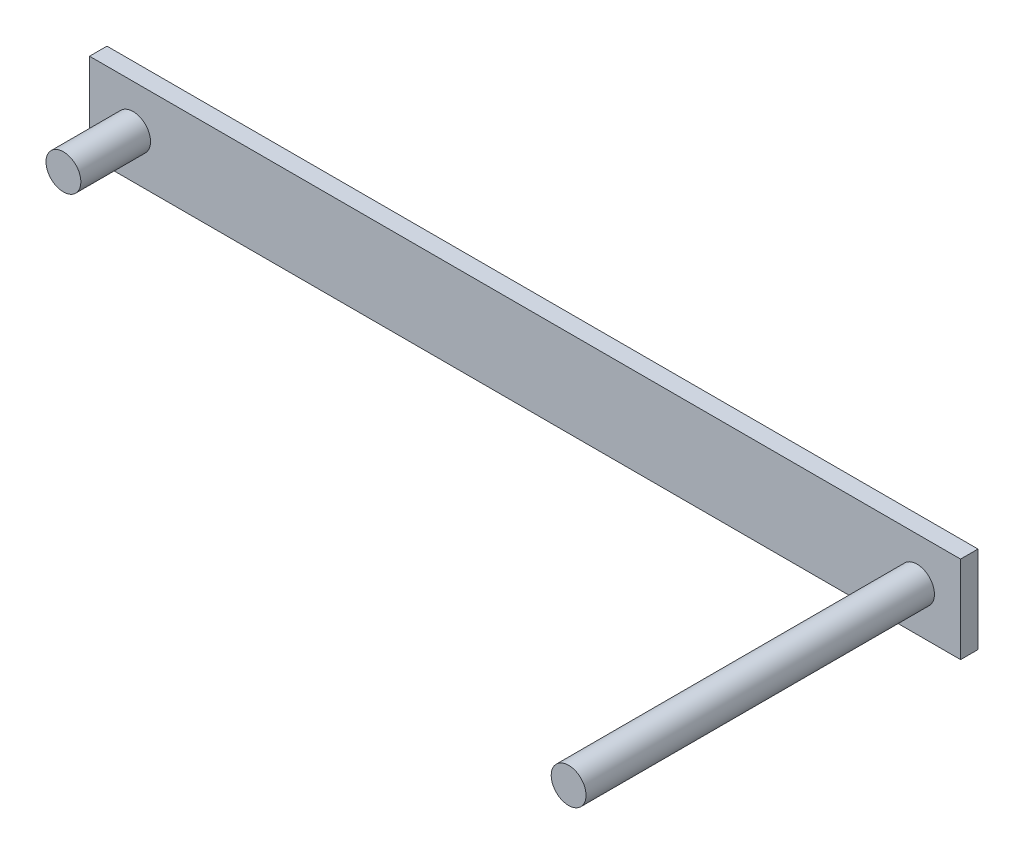
ISO-10303-21;
HEADER;
FILE_DESCRIPTION(('STEP AP214'),'2;1');
FILE_NAME('part.step','',(''),(''),'','','');
FILE_SCHEMA(('AUTOMOTIVE_DESIGN { 1 0 10303 214 1 1 1 1 }'));
ENDSEC;
DATA;
#1=APPLICATION_CONTEXT('core data for automotive mechanical design processes');
#2=APPLICATION_PROTOCOL_DEFINITION('international standard','automotive_design',2000,#1);
#3=PRODUCT_CONTEXT('',#1,'mechanical');
#4=PRODUCT('Part','Part','',(#3));
#5=PRODUCT_RELATED_PRODUCT_CATEGORY('part','',(#4));
#6=PRODUCT_DEFINITION_FORMATION('','',#4);
#7=PRODUCT_DEFINITION_CONTEXT('part definition',#1,'design');
#8=PRODUCT_DEFINITION('design','',#6,#7);
#9=PRODUCT_DEFINITION_SHAPE('','',#8);
#10=(LENGTH_UNIT() NAMED_UNIT(*) SI_UNIT(.MILLI.,.METRE.));
#11=(NAMED_UNIT(*) PLANE_ANGLE_UNIT() SI_UNIT($,.RADIAN.));
#12=(NAMED_UNIT(*) SI_UNIT($,.STERADIAN.) SOLID_ANGLE_UNIT());
#13=UNCERTAINTY_MEASURE_WITH_UNIT(LENGTH_MEASURE(1.E-05),#10,'distance_accuracy_value','');
#14=(GEOMETRIC_REPRESENTATION_CONTEXT(3) GLOBAL_UNCERTAINTY_ASSIGNED_CONTEXT((#13)) GLOBAL_UNIT_ASSIGNED_CONTEXT((#10,
#11,#12)) REPRESENTATION_CONTEXT('',''));
#15=CARTESIAN_POINT('',(0.,0.,0.));
#16=DIRECTION('',(0.,0.,1.));
#17=DIRECTION('',(1.,0.,0.));
#18=AXIS2_PLACEMENT_3D('',#15,#16,#17);
#19=CARTESIAN_POINT('',(0.,50.,10.));
#20=DIRECTION('',(0.,0.,-1.));
#21=DIRECTION('',(-1.,0.,0.));
#22=AXIS2_PLACEMENT_3D('',#19,#20,#21);
#23=PLANE('',#22);
#24=CARTESIAN_POINT('',(25.,25.,10.));
#25=DIRECTION('',(0.,0.,-1.));
#26=DIRECTION('',(-1.,0.,0.));
#27=AXIS2_PLACEMENT_3D('',#24,#25,#26);
#28=CIRCLE('',#27,10.);
#29=CARTESIAN_POINT('',(15.,25.,10.));
#30=VERTEX_POINT('',#29);
#31=EDGE_CURVE('E28',#30,#30,#28,.F.);
#32=ORIENTED_EDGE('',*,*,#31,.F.);
#33=EDGE_LOOP('',(#32));
#34=FACE_BOUND('',#33,.T.);
#35=DIRECTION('',(0.,-1.,0.));
#36=VECTOR('',#35,1.);
#37=CARTESIAN_POINT('',(0.,0.,10.));
#38=LINE('',#37,#36);
#39=CARTESIAN_POINT('',(0.,50.,10.));
#40=VERTEX_POINT('',#39);
#41=CARTESIAN_POINT('',(0.,0.,10.));
#42=VERTEX_POINT('',#41);
#43=EDGE_CURVE('E72',#40,#42,#38,.T.);
#44=ORIENTED_EDGE('',*,*,#43,.T.);
#45=DIRECTION('',(1.,0.,0.));
#46=VECTOR('',#45,1.);
#47=CARTESIAN_POINT('',(0.,0.,10.));
#48=LINE('',#47,#46);
#49=CARTESIAN_POINT('',(500.,0.,10.));
#50=VERTEX_POINT('',#49);
#51=EDGE_CURVE('E67',#42,#50,#48,.T.);
#52=ORIENTED_EDGE('',*,*,#51,.T.);
#53=DIRECTION('',(0.,1.,0.));
#54=VECTOR('',#53,1.);
#55=CARTESIAN_POINT('',(500.,0.,10.));
#56=LINE('',#55,#54);
#57=CARTESIAN_POINT('',(500.,50.,10.));
#58=VERTEX_POINT('',#57);
#59=EDGE_CURVE('E70',#50,#58,#56,.T.);
#60=ORIENTED_EDGE('',*,*,#59,.T.);
#61=DIRECTION('',(-1.,0.,0.));
#62=VECTOR('',#61,1.);
#63=CARTESIAN_POINT('',(0.,50.,10.));
#64=LINE('',#63,#62);
#65=EDGE_CURVE('E36',#58,#40,#64,.T.);
#66=ORIENTED_EDGE('',*,*,#65,.T.);
#67=EDGE_LOOP('',(#44,#52,#60,#66));
#68=FACE_BOUND('',#67,.T.);
#69=CARTESIAN_POINT('',(475.,25.,10.));
#70=DIRECTION('',(0.,0.,-1.));
#71=DIRECTION('',(-1.,0.,0.));
#72=AXIS2_PLACEMENT_3D('',#69,#70,#71);
#73=CIRCLE('',#72,10.);
#74=CARTESIAN_POINT('',(465.,25.,10.));
#75=VERTEX_POINT('',#74);
#76=EDGE_CURVE('E11',#75,#75,#73,.F.);
#77=ORIENTED_EDGE('',*,*,#76,.F.);
#78=EDGE_LOOP('',(#77));
#79=FACE_BOUND('',#78,.T.);
#80=ADVANCED_FACE('F19',(#34,#68,#79),#23,.F.);
#81=CARTESIAN_POINT('',(0.,0.,10.));
#82=DIRECTION('',(1.,0.,0.));
#83=DIRECTION('',(0.,0.,-1.));
#84=AXIS2_PLACEMENT_3D('',#81,#82,#83);
#85=PLANE('',#84);
#86=DIRECTION('',(0.,-1.,0.));
#87=VECTOR('',#86,1.);
#88=CARTESIAN_POINT('',(0.,0.,0.));
#89=LINE('',#88,#87);
#90=CARTESIAN_POINT('',(0.,50.,0.));
#91=VERTEX_POINT('',#90);
#92=CARTESIAN_POINT('',(0.,0.,0.));
#93=VERTEX_POINT('',#92);
#94=EDGE_CURVE('E87',#91,#93,#89,.T.);
#95=ORIENTED_EDGE('',*,*,#94,.T.);
#96=DIRECTION('',(0.,0.,-1.));
#97=VECTOR('',#96,1.);
#98=CARTESIAN_POINT('',(0.,0.,10.));
#99=LINE('',#98,#97);
#100=EDGE_CURVE('E78',#42,#93,#99,.T.);
#101=ORIENTED_EDGE('',*,*,#100,.F.);
#102=ORIENTED_EDGE('',*,*,#43,.F.);
#103=DIRECTION('',(0.,0.,-1.));
#104=VECTOR('',#103,1.);
#105=CARTESIAN_POINT('',(0.,50.,10.));
#106=LINE('',#105,#104);
#107=EDGE_CURVE('E83',#40,#91,#106,.T.);
#108=ORIENTED_EDGE('',*,*,#107,.T.);
#109=EDGE_LOOP('',(#95,#101,#102,#108));
#110=FACE_BOUND('',#109,.T.);
#111=ADVANCED_FACE('F21',(#110),#85,.F.);
#112=CARTESIAN_POINT('',(0.,0.,10.));
#113=DIRECTION('',(0.,1.,0.));
#114=DIRECTION('',(0.,0.,1.));
#115=AXIS2_PLACEMENT_3D('',#112,#113,#114);
#116=PLANE('',#115);
#117=DIRECTION('',(1.,0.,0.));
#118=VECTOR('',#117,1.);
#119=CARTESIAN_POINT('',(0.,0.,0.));
#120=LINE('',#119,#118);
#121=CARTESIAN_POINT('',(500.,0.,0.));
#122=VERTEX_POINT('',#121);
#123=EDGE_CURVE('E77',#93,#122,#120,.T.);
#124=ORIENTED_EDGE('',*,*,#123,.T.);
#125=DIRECTION('',(0.,0.,-1.));
#126=VECTOR('',#125,1.);
#127=CARTESIAN_POINT('',(500.,0.,10.));
#128=LINE('',#127,#126);
#129=EDGE_CURVE('E75',#50,#122,#128,.T.);
#130=ORIENTED_EDGE('',*,*,#129,.F.);
#131=ORIENTED_EDGE('',*,*,#51,.F.);
#132=ORIENTED_EDGE('',*,*,#100,.T.);
#133=EDGE_LOOP('',(#124,#130,#131,#132));
#134=FACE_BOUND('',#133,.T.);
#135=ADVANCED_FACE('F76',(#134),#116,.F.);
#136=CARTESIAN_POINT('',(500.,0.,10.));
#137=DIRECTION('',(-1.,0.,0.));
#138=DIRECTION('',(0.,0.,1.));
#139=AXIS2_PLACEMENT_3D('',#136,#137,#138);
#140=PLANE('',#139);
#141=DIRECTION('',(0.,1.,0.));
#142=VECTOR('',#141,1.);
#143=CARTESIAN_POINT('',(500.,0.,0.));
#144=LINE('',#143,#142);
#145=CARTESIAN_POINT('',(500.,50.,0.));
#146=VERTEX_POINT('',#145);
#147=EDGE_CURVE('E53',#122,#146,#144,.T.);
#148=ORIENTED_EDGE('',*,*,#147,.T.);
#149=DIRECTION('',(0.,0.,-1.));
#150=VECTOR('',#149,1.);
#151=CARTESIAN_POINT('',(500.,50.,10.));
#152=LINE('',#151,#150);
#153=EDGE_CURVE('E79',#58,#146,#152,.T.);
#154=ORIENTED_EDGE('',*,*,#153,.F.);
#155=ORIENTED_EDGE('',*,*,#59,.F.);
#156=ORIENTED_EDGE('',*,*,#129,.T.);
#157=EDGE_LOOP('',(#148,#154,#155,#156));
#158=FACE_BOUND('',#157,.T.);
#159=ADVANCED_FACE('F81',(#158),#140,.F.);
#160=CARTESIAN_POINT('',(0.,50.,10.));
#161=DIRECTION('',(0.,-1.,0.));
#162=DIRECTION('',(0.,0.,-1.));
#163=AXIS2_PLACEMENT_3D('',#160,#161,#162);
#164=PLANE('',#163);
#165=DIRECTION('',(-1.,0.,0.));
#166=VECTOR('',#165,1.);
#167=CARTESIAN_POINT('',(0.,50.,0.));
#168=LINE('',#167,#166);
#169=EDGE_CURVE('E59',#146,#91,#168,.T.);
#170=ORIENTED_EDGE('',*,*,#169,.T.);
#171=ORIENTED_EDGE('',*,*,#107,.F.);
#172=ORIENTED_EDGE('',*,*,#65,.F.);
#173=ORIENTED_EDGE('',*,*,#153,.T.);
#174=EDGE_LOOP('',(#170,#171,#172,#173));
#175=FACE_BOUND('',#174,.T.);
#176=ADVANCED_FACE('F115',(#175),#164,.F.);
#177=CARTESIAN_POINT('',(0.,50.,0.));
#178=DIRECTION('',(0.,0.,-1.));
#179=DIRECTION('',(-1.,0.,0.));
#180=AXIS2_PLACEMENT_3D('',#177,#178,#179);
#181=PLANE('',#180);
#182=ORIENTED_EDGE('',*,*,#94,.F.);
#183=ORIENTED_EDGE('',*,*,#169,.F.);
#184=ORIENTED_EDGE('',*,*,#147,.F.);
#185=ORIENTED_EDGE('',*,*,#123,.F.);
#186=EDGE_LOOP('',(#182,#183,#184,#185));
#187=FACE_BOUND('',#186,.T.);
#188=ADVANCED_FACE('F112',(#187),#181,.T.);
#189=CARTESIAN_POINT('',(25.,25.,50.));
#190=DIRECTION('',(0.,0.,-1.));
#191=DIRECTION('',(-1.,0.,0.));
#192=AXIS2_PLACEMENT_3D('',#189,#190,#191);
#193=CYLINDRICAL_SURFACE('',#192,10.);
#194=CARTESIAN_POINT('',(25.,25.,50.));
#195=DIRECTION('',(0.,0.,1.));
#196=DIRECTION('',(1.,0.,0.));
#197=AXIS2_PLACEMENT_3D('',#194,#195,#196);
#198=CIRCLE('',#197,10.);
#199=CARTESIAN_POINT('',(35.,25.,50.));
#200=VERTEX_POINT('',#199);
#201=EDGE_CURVE('E90',#200,#200,#198,.T.);
#202=ORIENTED_EDGE('',*,*,#201,.F.);
#203=EDGE_LOOP('',(#202));
#204=FACE_BOUND('',#203,.T.);
#205=ORIENTED_EDGE('',*,*,#31,.T.);
#206=EDGE_LOOP('',(#205));
#207=FACE_BOUND('',#206,.T.);
#208=ADVANCED_FACE('F99',(#204,#207),#193,.T.);
#209=CARTESIAN_POINT('',(250.,-365.989857453915,50.));
#210=DIRECTION('',(0.,0.,1.));
#211=DIRECTION('',(1.,0.,0.));
#212=AXIS2_PLACEMENT_3D('',#209,#210,#211);
#213=PLANE('',#212);
#214=ORIENTED_EDGE('',*,*,#201,.T.);
#215=EDGE_LOOP('',(#214));
#216=FACE_BOUND('',#215,.T.);
#217=ADVANCED_FACE('F152',(#216),#213,.T.);
#218=CARTESIAN_POINT('',(475.,25.,210.));
#219=DIRECTION('',(0.,0.,-1.));
#220=DIRECTION('',(-1.,0.,0.));
#221=AXIS2_PLACEMENT_3D('',#218,#219,#220);
#222=CYLINDRICAL_SURFACE('',#221,10.);
#223=CARTESIAN_POINT('',(475.,25.,210.));
#224=DIRECTION('',(0.,0.,1.));
#225=DIRECTION('',(1.,0.,0.));
#226=AXIS2_PLACEMENT_3D('',#223,#224,#225);
#227=CIRCLE('',#226,10.);
#228=CARTESIAN_POINT('',(485.,25.,210.));
#229=VERTEX_POINT('',#228);
#230=EDGE_CURVE('E200',#229,#229,#227,.T.);
#231=ORIENTED_EDGE('',*,*,#230,.F.);
#232=EDGE_LOOP('',(#231));
#233=FACE_BOUND('',#232,.T.);
#234=ORIENTED_EDGE('',*,*,#76,.T.);
#235=EDGE_LOOP('',(#234));
#236=FACE_BOUND('',#235,.T.);
#237=ADVANCED_FACE('F160',(#233,#236),#222,.T.);
#238=CARTESIAN_POINT('',(250.,-365.989857453915,210.));
#239=DIRECTION('',(0.,0.,1.));
#240=DIRECTION('',(1.,0.,0.));
#241=AXIS2_PLACEMENT_3D('',#238,#239,#240);
#242=PLANE('',#241);
#243=ORIENTED_EDGE('',*,*,#230,.T.);
#244=EDGE_LOOP('',(#243));
#245=FACE_BOUND('',#244,.T.);
#246=ADVANCED_FACE('F168',(#245),#242,.T.);
#247=CLOSED_SHELL('',(#80,#111,#135,#159,#176,#188,#208,#217,#237,#246));
#248=MANIFOLD_SOLID_BREP('B1',#247);
#249=ADVANCED_BREP_SHAPE_REPRESENTATION('',(#18,#248),#14);
#250=SHAPE_DEFINITION_REPRESENTATION(#9,#249);
ENDSEC;
END-ISO-10303-21;
